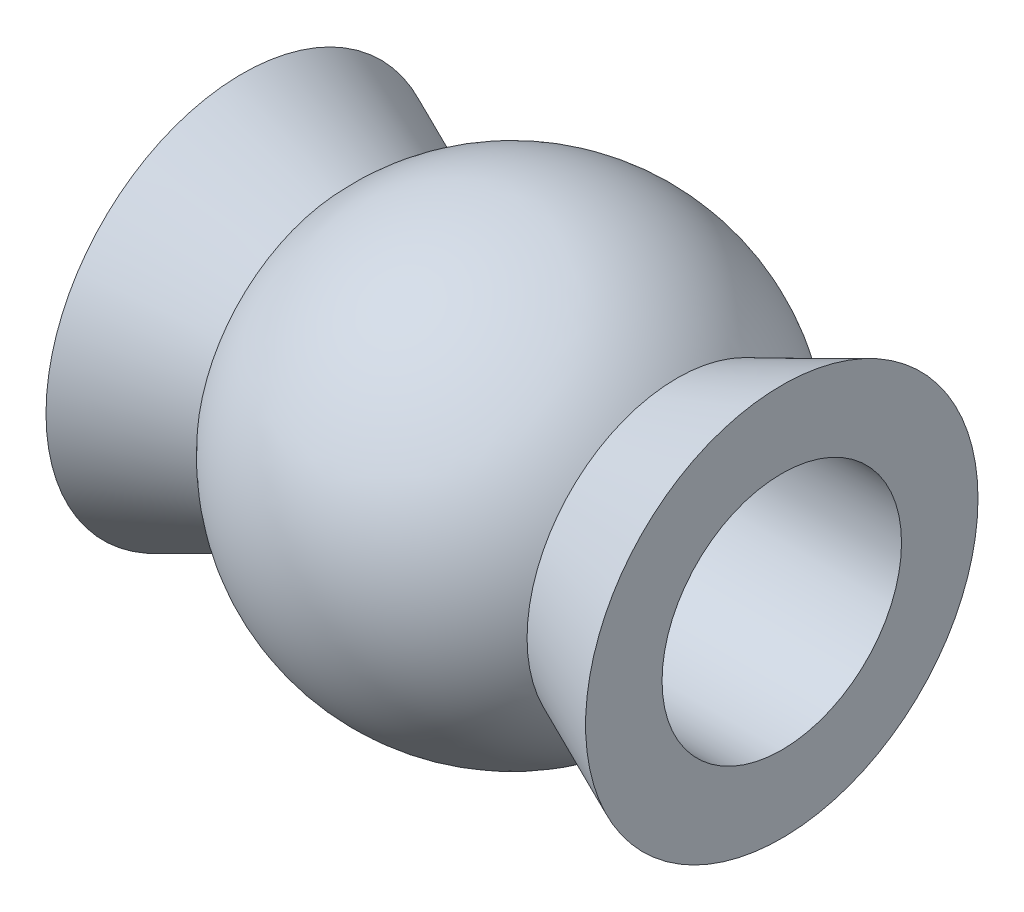
ISO-10303-21;
HEADER;
FILE_DESCRIPTION(('STEP AP214'),'2;1');
FILE_NAME('part.step','',(''),(''),'','','');
FILE_SCHEMA(('AUTOMOTIVE_DESIGN { 1 0 10303 214 1 1 1 1 }'));
ENDSEC;
DATA;
#1=APPLICATION_CONTEXT('core data for automotive mechanical design processes');
#2=APPLICATION_PROTOCOL_DEFINITION('international standard','automotive_design',2000,#1);
#3=PRODUCT_CONTEXT('',#1,'mechanical');
#4=PRODUCT('Part','Part','',(#3));
#5=PRODUCT_RELATED_PRODUCT_CATEGORY('part','',(#4));
#6=PRODUCT_DEFINITION_FORMATION('','',#4);
#7=PRODUCT_DEFINITION_CONTEXT('part definition',#1,'design');
#8=PRODUCT_DEFINITION('design','',#6,#7);
#9=PRODUCT_DEFINITION_SHAPE('','',#8);
#10=(LENGTH_UNIT() NAMED_UNIT(*) SI_UNIT(.MILLI.,.METRE.));
#11=(NAMED_UNIT(*) PLANE_ANGLE_UNIT() SI_UNIT($,.RADIAN.));
#12=(NAMED_UNIT(*) SI_UNIT($,.STERADIAN.) SOLID_ANGLE_UNIT());
#13=UNCERTAINTY_MEASURE_WITH_UNIT(LENGTH_MEASURE(1.E-05),#10,'distance_accuracy_value','');
#14=(GEOMETRIC_REPRESENTATION_CONTEXT(3) GLOBAL_UNCERTAINTY_ASSIGNED_CONTEXT((#13)) GLOBAL_UNIT_ASSIGNED_CONTEXT((#10,
#11,#12)) REPRESENTATION_CONTEXT('',''));
#15=CARTESIAN_POINT('',(0.,0.,0.));
#16=DIRECTION('',(0.,0.,1.));
#17=DIRECTION('',(1.,0.,0.));
#18=AXIS2_PLACEMENT_3D('',#15,#16,#17);
#19=CARTESIAN_POINT('',(3.49250000000001,0.,0.));
#20=DIRECTION('',(-1.,0.,0.));
#21=DIRECTION('',(0.,0.,1.));
#22=AXIS2_PLACEMENT_3D('',#19,#20,#21);
#23=PLANE('',#22);
#24=CARTESIAN_POINT('',(3.49249999993617,0.,0.));
#25=DIRECTION('',(-1.,0.,0.));
#26=DIRECTION('',(0.,0.,1.));
#27=AXIS2_PLACEMENT_3D('',#24,#25,#26);
#28=CIRCLE('',#27,1.54999999999999);
#29=CARTESIAN_POINT('',(3.49249999993617,0.,1.54999999999998));
#30=VERTEX_POINT('',#29);
#31=EDGE_CURVE('E54',#30,#30,#28,.T.);
#32=ORIENTED_EDGE('',*,*,#31,.T.);
#33=EDGE_LOOP('',(#32));
#34=FACE_BOUND('',#33,.T.);
#35=CARTESIAN_POINT('',(3.49249999993617,0.,0.));
#36=DIRECTION('',(1.,0.,0.));
#37=DIRECTION('',(0.,0.,-1.));
#38=AXIS2_PLACEMENT_3D('',#35,#36,#37);
#39=CIRCLE('',#38,2.53999999999695);
#40=CARTESIAN_POINT('',(3.49249999993617,0.,-2.53999999999695));
#41=VERTEX_POINT('',#40);
#42=EDGE_CURVE('E43',#41,#41,#39,.F.);
#43=ORIENTED_EDGE('',*,*,#42,.F.);
#44=EDGE_LOOP('',(#43));
#45=FACE_BOUND('',#44,.T.);
#46=ADVANCED_FACE('F40',(#34,#45),#23,.F.);
#47=CARTESIAN_POINT('',(-3.4925,0.,-2.54));
#48=DIRECTION('',(1.,0.,0.));
#49=DIRECTION('',(0.,0.,-1.));
#50=AXIS2_PLACEMENT_3D('',#47,#48,#49);
#51=PLANE('',#50);
#52=CARTESIAN_POINT('',(-3.4925,0.,0.));
#53=DIRECTION('',(-1.,0.,0.));
#54=DIRECTION('',(0.,0.,1.));
#55=AXIS2_PLACEMENT_3D('',#52,#53,#54);
#56=CIRCLE('',#55,1.54999999999999);
#57=CARTESIAN_POINT('',(-3.4925,0.,1.54999999999999));
#58=VERTEX_POINT('',#57);
#59=EDGE_CURVE('E58',#58,#58,#56,.T.);
#60=ORIENTED_EDGE('',*,*,#59,.F.);
#61=EDGE_LOOP('',(#60));
#62=FACE_BOUND('',#61,.T.);
#63=CARTESIAN_POINT('',(-3.49249999987933,0.,0.));
#64=DIRECTION('',(-1.,0.,0.));
#65=DIRECTION('',(0.,0.,1.));
#66=AXIS2_PLACEMENT_3D('',#63,#64,#65);
#67=CIRCLE('',#66,2.53999999997189);
#68=CARTESIAN_POINT('',(-3.49249999987933,0.,2.5399999999719));
#69=VERTEX_POINT('',#68);
#70=EDGE_CURVE('E11',#69,#69,#67,.F.);
#71=ORIENTED_EDGE('',*,*,#70,.F.);
#72=EDGE_LOOP('',(#71));
#73=FACE_BOUND('',#72,.T.);
#74=ADVANCED_FACE('F82',(#62,#73),#51,.F.);
#75=CARTESIAN_POINT('',(3.4924999997088,0.,0.));
#76=DIRECTION('',(1.,0.,0.));
#77=DIRECTION('',(0.,0.,-1.));
#78=AXIS2_PLACEMENT_3D('',#75,#76,#77);
#79=CONICAL_SURFACE('',#78,2.53999999989673,0.415144850367374);
#80=ORIENTED_EDGE('',*,*,#42,.T.);
#81=EDGE_LOOP('',(#80));
#82=FACE_BOUND('',#81,.T.);
#83=CARTESIAN_POINT('',(2.13825348180308,0.,0.));
#84=DIRECTION('',(-1.,0.,0.));
#85=DIRECTION('',(0.,0.,1.));
#86=AXIS2_PLACEMENT_3D('',#83,#84,#85);
#87=CIRCLE('',#86,1.94309999998858);
#88=CARTESIAN_POINT('',(2.13825348180308,0.,1.94309999998858));
#89=VERTEX_POINT('',#88);
#90=EDGE_CURVE('E61',#89,#89,#87,.T.);
#91=ORIENTED_EDGE('',*,*,#90,.F.);
#92=EDGE_LOOP('',(#91));
#93=FACE_BOUND('',#92,.T.);
#94=ADVANCED_FACE('F80',(#82,#93),#79,.T.);
#95=CARTESIAN_POINT('',(-3.4924999997088,0.,0.));
#96=DIRECTION('',(-1.,0.,0.));
#97=DIRECTION('',(0.,0.,1.));
#98=AXIS2_PLACEMENT_3D('',#95,#96,#97);
#99=CONICAL_SURFACE('',#98,2.53999999989673,0.41514485036321);
#100=CARTESIAN_POINT('',(-2.13825348180308,0.,0.));
#101=DIRECTION('',(1.,0.,0.));
#102=DIRECTION('',(0.,0.,-1.));
#103=AXIS2_PLACEMENT_3D('',#100,#101,#102);
#104=CIRCLE('',#103,1.94309999999195);
#105=CARTESIAN_POINT('',(-2.13825348180308,0.,-1.94309999999194));
#106=VERTEX_POINT('',#105);
#107=EDGE_CURVE('E65',#106,#106,#104,.F.);
#108=ORIENTED_EDGE('',*,*,#107,.T.);
#109=EDGE_LOOP('',(#108));
#110=FACE_BOUND('',#109,.T.);
#111=ORIENTED_EDGE('',*,*,#70,.T.);
#112=EDGE_LOOP('',(#111));
#113=FACE_BOUND('',#112,.T.);
#114=ADVANCED_FACE('F71',(#110,#113),#99,.T.);
#115=CARTESIAN_POINT('',(-3.4925,0.,0.));
#116=DIRECTION('',(-1.,0.,0.));
#117=DIRECTION('',(0.,0.,1.));
#118=AXIS2_PLACEMENT_3D('',#115,#116,#117);
#119=CYLINDRICAL_SURFACE('',#118,1.54999999999999);
#120=ORIENTED_EDGE('',*,*,#31,.F.);
#121=EDGE_LOOP('',(#120));
#122=FACE_BOUND('',#121,.T.);
#123=ORIENTED_EDGE('',*,*,#59,.T.);
#124=EDGE_LOOP('',(#123));
#125=FACE_BOUND('',#124,.T.);
#126=ADVANCED_FACE('F76',(#122,#125),#119,.F.);
#127=CARTESIAN_POINT('',(0.,0.,0.));
#128=DIRECTION('',(-1.,0.,0.));
#129=DIRECTION('',(0.,0.,-1.));
#130=AXIS2_PLACEMENT_3D('',#127,#128,#129);
#131=SPHERICAL_SURFACE('',#130,2.88924999998472);
#132=ORIENTED_EDGE('',*,*,#107,.F.);
#133=EDGE_LOOP('',(#132));
#134=FACE_BOUND('',#133,.T.);
#135=ORIENTED_EDGE('',*,*,#90,.T.);
#136=EDGE_LOOP('',(#135));
#137=FACE_BOUND('',#136,.T.);
#138=ADVANCED_FACE('F73',(#134,#137),#131,.T.);
#139=CLOSED_SHELL('',(#46,#74,#94,#114,#126,#138));
#140=MANIFOLD_SOLID_BREP('B2',#139);
#141=ADVANCED_BREP_SHAPE_REPRESENTATION('',(#18,#140),#14);
#142=SHAPE_DEFINITION_REPRESENTATION(#9,#141);
ENDSEC;
END-ISO-10303-21;
